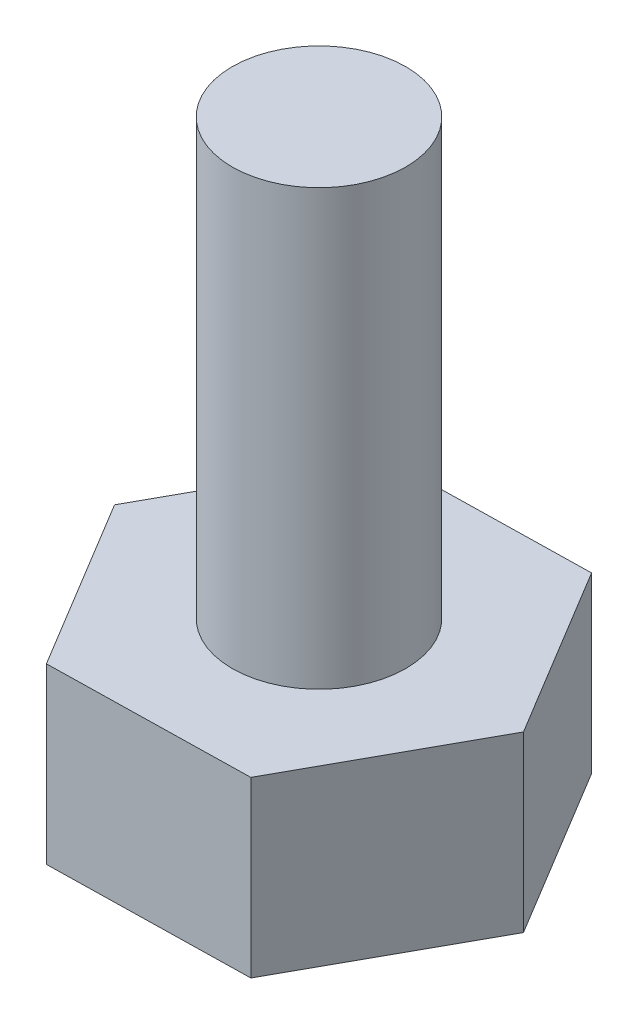
ISO-10303-21;
HEADER;
FILE_DESCRIPTION(('STEP AP214'),'2;1');
FILE_NAME('part.step','',(''),(''),'','','');
FILE_SCHEMA(('AUTOMOTIVE_DESIGN { 1 0 10303 214 1 1 1 1 }'));
ENDSEC;
DATA;
#1=APPLICATION_CONTEXT('core data for automotive mechanical design processes');
#2=APPLICATION_PROTOCOL_DEFINITION('international standard','automotive_design',2000,#1);
#3=PRODUCT_CONTEXT('',#1,'mechanical');
#4=PRODUCT('Part','Part','',(#3));
#5=PRODUCT_RELATED_PRODUCT_CATEGORY('part','',(#4));
#6=PRODUCT_DEFINITION_FORMATION('','',#4);
#7=PRODUCT_DEFINITION_CONTEXT('part definition',#1,'design');
#8=PRODUCT_DEFINITION('design','',#6,#7);
#9=PRODUCT_DEFINITION_SHAPE('','',#8);
#10=(LENGTH_UNIT() NAMED_UNIT(*) SI_UNIT(.MILLI.,.METRE.));
#11=(NAMED_UNIT(*) PLANE_ANGLE_UNIT() SI_UNIT($,.RADIAN.));
#12=(NAMED_UNIT(*) SI_UNIT($,.STERADIAN.) SOLID_ANGLE_UNIT());
#13=UNCERTAINTY_MEASURE_WITH_UNIT(LENGTH_MEASURE(1.E-05),#10,'distance_accuracy_value','');
#14=(GEOMETRIC_REPRESENTATION_CONTEXT(3) GLOBAL_UNCERTAINTY_ASSIGNED_CONTEXT((#13)) GLOBAL_UNIT_ASSIGNED_CONTEXT((#10,
#11,#12)) REPRESENTATION_CONTEXT('',''));
#15=CARTESIAN_POINT('',(0.,0.,0.));
#16=DIRECTION('',(0.,0.,1.));
#17=DIRECTION('',(1.,0.,0.));
#18=AXIS2_PLACEMENT_3D('',#15,#16,#17);
#19=CARTESIAN_POINT('',(-18.8764059971618,10.,12.7106786421223));
#20=DIRECTION('',(0.,-1.,0.));
#21=DIRECTION('',(0.,0.,-1.));
#22=AXIS2_PLACEMENT_3D('',#19,#20,#21);
#23=CYLINDRICAL_SURFACE('',#22,2.);
#24=CARTESIAN_POINT('',(-18.8764059971618,10.,12.7106786421223));
#25=DIRECTION('',(0.,1.,0.));
#26=DIRECTION('',(0.,0.,1.));
#27=AXIS2_PLACEMENT_3D('',#24,#25,#26);
#28=CIRCLE('',#27,2.);
#29=CARTESIAN_POINT('',(-18.8764059971618,10.,14.7106786421223));
#30=VERTEX_POINT('',#29);
#31=EDGE_CURVE('E11',#30,#30,#28,.T.);
#32=ORIENTED_EDGE('',*,*,#31,.F.);
#33=EDGE_LOOP('',(#32));
#34=FACE_BOUND('',#33,.T.);
#35=CARTESIAN_POINT('',(-18.8764059971618,0.,12.7106786421223));
#36=DIRECTION('',(0.,-1.,0.));
#37=DIRECTION('',(0.,0.,-1.));
#38=AXIS2_PLACEMENT_3D('',#35,#36,#37);
#39=CIRCLE('',#38,2.);
#40=CARTESIAN_POINT('',(-18.8764059971618,0.,10.7106786421223));
#41=VERTEX_POINT('',#40);
#42=EDGE_CURVE('E41',#41,#41,#39,.T.);
#43=ORIENTED_EDGE('',*,*,#42,.F.);
#44=EDGE_LOOP('',(#43));
#45=FACE_BOUND('',#44,.T.);
#46=ADVANCED_FACE('F33',(#34,#45),#23,.T.);
#47=CARTESIAN_POINT('',(-18.8764059971618,10.,12.7106786421223));
#48=DIRECTION('',(0.,1.,0.));
#49=DIRECTION('',(0.,0.,1.));
#50=AXIS2_PLACEMENT_3D('',#47,#48,#49);
#51=PLANE('',#50);
#52=ORIENTED_EDGE('',*,*,#31,.T.);
#53=EDGE_LOOP('',(#52));
#54=FACE_BOUND('',#53,.T.);
#55=ADVANCED_FACE('F142',(#54),#51,.T.);
#56=CARTESIAN_POINT('',(-16.4901459386641,0.,16.6653083677163));
#57=DIRECTION('',(0.,-1.,0.));
#58=DIRECTION('',(0.,0.,-1.));
#59=AXIS2_PLACEMENT_3D('',#56,#57,#58);
#60=PLANE('',#59);
#61=DIRECTION('',(-0.483172844711996,0.,0.875524986584002));
#62=VECTOR('',#61,1.);
#63=CARTESIAN_POINT('',(-14.2584661629874,0.,12.6214316742242));
#64=LINE('',#63,#62);
#65=CARTESIAN_POINT('',(-14.2584661629874,0.,12.6214316742242));
#66=VERTEX_POINT('',#65);
#67=CARTESIAN_POINT('',(-16.4901459386641,0.,16.6653083677163));
#68=VERTEX_POINT('',#67);
#69=EDGE_CURVE('E118',#66,#68,#64,.T.);
#70=ORIENTED_EDGE('',*,*,#69,.F.);
#71=DIRECTION('',(0.516640457673778,0.,0.856202451231383));
#72=VECTOR('',#71,1.);
#73=CARTESIAN_POINT('',(-16.6447262214851,0.,8.66680194863014));
#74=LINE('',#73,#72);
#75=CARTESIAN_POINT('',(-16.6447262214851,0.,8.66680194863014));
#76=VERTEX_POINT('',#75);
#77=EDGE_CURVE('E78',#76,#66,#74,.T.);
#78=ORIENTED_EDGE('',*,*,#77,.F.);
#79=DIRECTION('',(0.999813302385774,0.,-0.0193225353526195));
#80=VECTOR('',#79,1.);
#81=CARTESIAN_POINT('',(-21.2626660556594,0.,8.75604891652822));
#82=LINE('',#81,#80);
#83=CARTESIAN_POINT('',(-21.2626660556594,0.,8.75604891652822));
#84=VERTEX_POINT('',#83);
#85=EDGE_CURVE('E72',#84,#76,#82,.T.);
#86=ORIENTED_EDGE('',*,*,#85,.F.);
#87=DIRECTION('',(0.483172844711996,0.,-0.875524986584002));
#88=VECTOR('',#87,1.);
#89=CARTESIAN_POINT('',(-23.4943458313361,0.,12.7999256100204));
#90=LINE('',#89,#88);
#91=CARTESIAN_POINT('',(-23.4943458313361,0.,12.7999256100204));
#92=VERTEX_POINT('',#91);
#93=EDGE_CURVE('E108',#92,#84,#90,.T.);
#94=ORIENTED_EDGE('',*,*,#93,.F.);
#95=DIRECTION('',(-0.516640457673778,0.,-0.856202451231383));
#96=VECTOR('',#95,1.);
#97=CARTESIAN_POINT('',(-21.1080857728385,0.,16.7545553356144));
#98=LINE('',#97,#96);
#99=CARTESIAN_POINT('',(-21.1080857728385,0.,16.7545553356144));
#100=VERTEX_POINT('',#99);
#101=EDGE_CURVE('E123',#100,#92,#98,.T.);
#102=ORIENTED_EDGE('',*,*,#101,.F.);
#103=DIRECTION('',(-0.999813302385774,0.,0.0193225353526199));
#104=VECTOR('',#103,1.);
#105=CARTESIAN_POINT('',(-16.4901459386641,0.,16.6653083677163));
#106=LINE('',#105,#104);
#107=EDGE_CURVE('E121',#68,#100,#106,.T.);
#108=ORIENTED_EDGE('',*,*,#107,.F.);
#109=EDGE_LOOP('',(#70,#78,#86,#94,#102,#108));
#110=FACE_BOUND('',#109,.T.);
#111=ORIENTED_EDGE('',*,*,#42,.T.);
#112=EDGE_LOOP('',(#111));
#113=FACE_BOUND('',#112,.T.);
#114=ADVANCED_FACE('F139',(#110,#113),#60,.F.);
#115=CARTESIAN_POINT('',(-14.2584661629874,-4.,12.6214316742242));
#116=DIRECTION('',(-0.875524986584002,0.,-0.483172844711996));
#117=DIRECTION('',(-0.483172844711996,0.,0.875524986584002));
#118=AXIS2_PLACEMENT_3D('',#115,#116,#117);
#119=PLANE('',#118);
#120=ORIENTED_EDGE('',*,*,#69,.T.);
#121=DIRECTION('',(0.,1.,0.));
#122=VECTOR('',#121,1.);
#123=CARTESIAN_POINT('',(-16.4901459386641,-4.,16.6653083677163));
#124=LINE('',#123,#122);
#125=CARTESIAN_POINT('',(-16.4901459386641,-4.,16.6653083677163));
#126=VERTEX_POINT('',#125);
#127=EDGE_CURVE('E135',#126,#68,#124,.T.);
#128=ORIENTED_EDGE('',*,*,#127,.F.);
#129=DIRECTION('',(-0.483172844711996,0.,0.875524986584002));
#130=VECTOR('',#129,1.);
#131=CARTESIAN_POINT('',(-14.2584661629874,-4.,12.6214316742242));
#132=LINE('',#131,#130);
#133=CARTESIAN_POINT('',(-14.2584661629874,-4.,12.6214316742242));
#134=VERTEX_POINT('',#133);
#135=EDGE_CURVE('E128',#134,#126,#132,.T.);
#136=ORIENTED_EDGE('',*,*,#135,.F.);
#137=DIRECTION('',(0.,1.,0.));
#138=VECTOR('',#137,1.);
#139=CARTESIAN_POINT('',(-14.2584661629874,-4.,12.6214316742242));
#140=LINE('',#139,#138);
#141=EDGE_CURVE('E114',#134,#66,#140,.T.);
#142=ORIENTED_EDGE('',*,*,#141,.T.);
#143=EDGE_LOOP('',(#120,#128,#136,#142));
#144=FACE_BOUND('',#143,.T.);
#145=ADVANCED_FACE('F152',(#144),#119,.F.);
#146=CARTESIAN_POINT('',(-16.4901459386641,-4.,16.6653083677163));
#147=DIRECTION('',(-0.0193225353526199,0.,-0.999813302385774));
#148=DIRECTION('',(-0.999813302385774,0.,0.0193225353526199));
#149=AXIS2_PLACEMENT_3D('',#146,#147,#148);
#150=PLANE('',#149);
#151=ORIENTED_EDGE('',*,*,#107,.T.);
#152=DIRECTION('',(0.,1.,0.));
#153=VECTOR('',#152,1.);
#154=CARTESIAN_POINT('',(-21.1080857728385,-4.,16.7545553356144));
#155=LINE('',#154,#153);
#156=CARTESIAN_POINT('',(-21.1080857728385,-4.,16.7545553356144));
#157=VERTEX_POINT('',#156);
#158=EDGE_CURVE('E132',#157,#100,#155,.T.);
#159=ORIENTED_EDGE('',*,*,#158,.F.);
#160=DIRECTION('',(-0.999813302385774,0.,0.0193225353526199));
#161=VECTOR('',#160,1.);
#162=CARTESIAN_POINT('',(-16.4901459386641,-4.,16.6653083677163));
#163=LINE('',#162,#161);
#164=EDGE_CURVE('E87',#126,#157,#163,.T.);
#165=ORIENTED_EDGE('',*,*,#164,.F.);
#166=ORIENTED_EDGE('',*,*,#127,.T.);
#167=EDGE_LOOP('',(#151,#159,#165,#166));
#168=FACE_BOUND('',#167,.T.);
#169=ADVANCED_FACE('F158',(#168),#150,.F.);
#170=CARTESIAN_POINT('',(-21.1080857728385,-4.,16.7545553356144));
#171=DIRECTION('',(0.856202451231383,0.,-0.516640457673778));
#172=DIRECTION('',(-0.516640457673778,0.,-0.856202451231383));
#173=AXIS2_PLACEMENT_3D('',#170,#171,#172);
#174=PLANE('',#173);
#175=ORIENTED_EDGE('',*,*,#101,.T.);
#176=DIRECTION('',(0.,1.,0.));
#177=VECTOR('',#176,1.);
#178=CARTESIAN_POINT('',(-23.4943458313361,-4.,12.7999256100204));
#179=LINE('',#178,#177);
#180=CARTESIAN_POINT('',(-23.4943458313361,-4.,12.7999256100204));
#181=VERTEX_POINT('',#180);
#182=EDGE_CURVE('E109',#181,#92,#179,.T.);
#183=ORIENTED_EDGE('',*,*,#182,.F.);
#184=DIRECTION('',(-0.516640457673778,0.,-0.856202451231383));
#185=VECTOR('',#184,1.);
#186=CARTESIAN_POINT('',(-21.1080857728385,-4.,16.7545553356144));
#187=LINE('',#186,#185);
#188=EDGE_CURVE('E100',#157,#181,#187,.T.);
#189=ORIENTED_EDGE('',*,*,#188,.F.);
#190=ORIENTED_EDGE('',*,*,#158,.T.);
#191=EDGE_LOOP('',(#175,#183,#189,#190));
#192=FACE_BOUND('',#191,.T.);
#193=ADVANCED_FACE('F162',(#192),#174,.F.);
#194=CARTESIAN_POINT('',(-23.4943458313361,-4.,12.7999256100204));
#195=DIRECTION('',(0.875524986584002,0.,0.483172844711996));
#196=DIRECTION('',(0.483172844711996,0.,-0.875524986584003));
#197=AXIS2_PLACEMENT_3D('',#194,#195,#196);
#198=PLANE('',#197);
#199=ORIENTED_EDGE('',*,*,#93,.T.);
#200=DIRECTION('',(0.,1.,0.));
#201=VECTOR('',#200,1.);
#202=CARTESIAN_POINT('',(-21.2626660556594,-4.,8.75604891652822));
#203=LINE('',#202,#201);
#204=CARTESIAN_POINT('',(-21.2626660556594,-4.,8.75604891652822));
#205=VERTEX_POINT('',#204);
#206=EDGE_CURVE('E105',#205,#84,#203,.T.);
#207=ORIENTED_EDGE('',*,*,#206,.F.);
#208=DIRECTION('',(0.483172844711996,0.,-0.875524986584002));
#209=VECTOR('',#208,1.);
#210=CARTESIAN_POINT('',(-23.4943458313361,-4.,12.7999256100204));
#211=LINE('',#210,#209);
#212=EDGE_CURVE('E94',#181,#205,#211,.T.);
#213=ORIENTED_EDGE('',*,*,#212,.F.);
#214=ORIENTED_EDGE('',*,*,#182,.T.);
#215=EDGE_LOOP('',(#199,#207,#213,#214));
#216=FACE_BOUND('',#215,.T.);
#217=ADVANCED_FACE('F106',(#216),#198,.F.);
#218=CARTESIAN_POINT('',(-21.2626660556594,-4.,8.75604891652822));
#219=DIRECTION('',(0.0193225353526195,0.,0.999813302385774));
#220=DIRECTION('',(0.999813302385774,0.,-0.0193225353526195));
#221=AXIS2_PLACEMENT_3D('',#218,#219,#220);
#222=PLANE('',#221);
#223=ORIENTED_EDGE('',*,*,#85,.T.);
#224=DIRECTION('',(0.,1.,0.));
#225=VECTOR('',#224,1.);
#226=CARTESIAN_POINT('',(-16.6447262214851,-4.,8.66680194863014));
#227=LINE('',#226,#225);
#228=CARTESIAN_POINT('',(-16.6447262214851,-4.,8.66680194863014));
#229=VERTEX_POINT('',#228);
#230=EDGE_CURVE('E110',#229,#76,#227,.T.);
#231=ORIENTED_EDGE('',*,*,#230,.F.);
#232=DIRECTION('',(0.999813302385774,0.,-0.0193225353526195));
#233=VECTOR('',#232,1.);
#234=CARTESIAN_POINT('',(-21.2626660556594,-4.,8.75604891652822));
#235=LINE('',#234,#233);
#236=EDGE_CURVE('E98',#205,#229,#235,.T.);
#237=ORIENTED_EDGE('',*,*,#236,.F.);
#238=ORIENTED_EDGE('',*,*,#206,.T.);
#239=EDGE_LOOP('',(#223,#231,#237,#238));
#240=FACE_BOUND('',#239,.T.);
#241=ADVANCED_FACE('F112',(#240),#222,.F.);
#242=CARTESIAN_POINT('',(-16.6447262214851,-4.,8.66680194863014));
#243=DIRECTION('',(-0.856202451231383,0.,0.516640457673778));
#244=DIRECTION('',(0.516640457673778,0.,0.856202451231383));
#245=AXIS2_PLACEMENT_3D('',#242,#243,#244);
#246=PLANE('',#245);
#247=ORIENTED_EDGE('',*,*,#77,.T.);
#248=ORIENTED_EDGE('',*,*,#141,.F.);
#249=DIRECTION('',(0.516640457673778,0.,0.856202451231383));
#250=VECTOR('',#249,1.);
#251=CARTESIAN_POINT('',(-16.6447262214851,-4.,8.66680194863014));
#252=LINE('',#251,#250);
#253=EDGE_CURVE('E49',#229,#134,#252,.T.);
#254=ORIENTED_EDGE('',*,*,#253,.F.);
#255=ORIENTED_EDGE('',*,*,#230,.T.);
#256=EDGE_LOOP('',(#247,#248,#254,#255));
#257=FACE_BOUND('',#256,.T.);
#258=ADVANCED_FACE('F170',(#257),#246,.F.);
#259=CARTESIAN_POINT('',(-16.4901459386641,-4.,16.6653083677163));
#260=DIRECTION('',(0.,-1.,0.));
#261=DIRECTION('',(0.,0.,-1.));
#262=AXIS2_PLACEMENT_3D('',#259,#260,#261);
#263=PLANE('',#262);
#264=ORIENTED_EDGE('',*,*,#135,.T.);
#265=ORIENTED_EDGE('',*,*,#164,.T.);
#266=ORIENTED_EDGE('',*,*,#188,.T.);
#267=ORIENTED_EDGE('',*,*,#212,.T.);
#268=ORIENTED_EDGE('',*,*,#236,.T.);
#269=ORIENTED_EDGE('',*,*,#253,.T.);
#270=EDGE_LOOP('',(#264,#265,#266,#267,#268,#269));
#271=FACE_BOUND('',#270,.T.);
#272=ADVANCED_FACE('F96',(#271),#263,.T.);
#273=CLOSED_SHELL('',(#46,#55,#114,#145,#169,#193,#217,#241,#258,#272));
#274=MANIFOLD_SOLID_BREP('B2',#273);
#275=ADVANCED_BREP_SHAPE_REPRESENTATION('',(#18,#274),#14);
#276=SHAPE_DEFINITION_REPRESENTATION(#9,#275);
ENDSEC;
END-ISO-10303-21;
